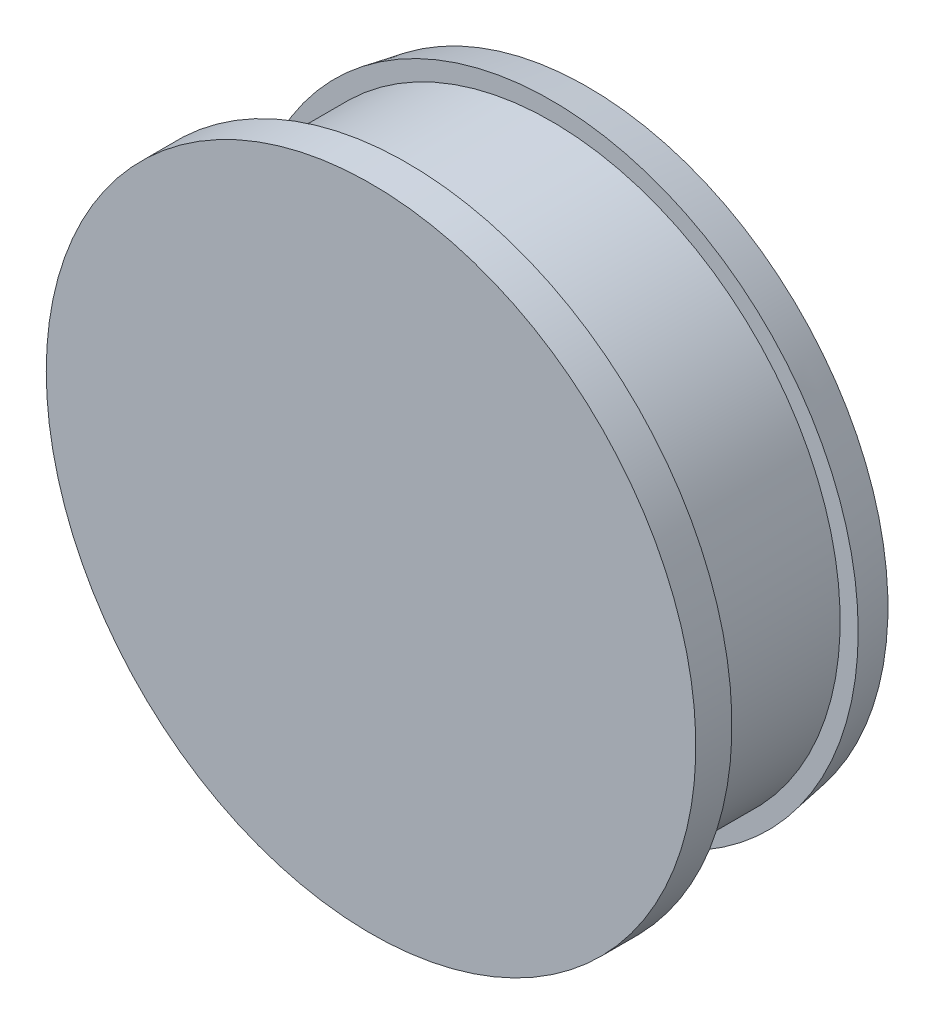
ISO-10303-21;
HEADER;
FILE_DESCRIPTION(('STEP AP214'),'2;1');
FILE_NAME('part.step','',(''),(''),'','','');
FILE_SCHEMA(('AUTOMOTIVE_DESIGN { 1 0 10303 214 1 1 1 1 }'));
ENDSEC;
DATA;
#1=APPLICATION_CONTEXT('core data for automotive mechanical design processes');
#2=APPLICATION_PROTOCOL_DEFINITION('international standard','automotive_design',2000,#1);
#3=PRODUCT_CONTEXT('',#1,'mechanical');
#4=PRODUCT('Part','Part','',(#3));
#5=PRODUCT_RELATED_PRODUCT_CATEGORY('part','',(#4));
#6=PRODUCT_DEFINITION_FORMATION('','',#4);
#7=PRODUCT_DEFINITION_CONTEXT('part definition',#1,'design');
#8=PRODUCT_DEFINITION('design','',#6,#7);
#9=PRODUCT_DEFINITION_SHAPE('','',#8);
#10=(LENGTH_UNIT() NAMED_UNIT(*) SI_UNIT(.MILLI.,.METRE.));
#11=(NAMED_UNIT(*) PLANE_ANGLE_UNIT() SI_UNIT($,.RADIAN.));
#12=(NAMED_UNIT(*) SI_UNIT($,.STERADIAN.) SOLID_ANGLE_UNIT());
#13=UNCERTAINTY_MEASURE_WITH_UNIT(LENGTH_MEASURE(1.E-05),#10,'distance_accuracy_value','');
#14=(GEOMETRIC_REPRESENTATION_CONTEXT(3) GLOBAL_UNCERTAINTY_ASSIGNED_CONTEXT((#13)) GLOBAL_UNIT_ASSIGNED_CONTEXT((#10,
#11,#12)) REPRESENTATION_CONTEXT('',''));
#15=CARTESIAN_POINT('',(0.,0.,0.));
#16=DIRECTION('',(0.,0.,1.));
#17=DIRECTION('',(1.,0.,0.));
#18=AXIS2_PLACEMENT_3D('',#15,#16,#17);
#19=CARTESIAN_POINT('',(0.,0.,0.));
#20=DIRECTION('',(0.,0.,1.));
#21=DIRECTION('',(1.,0.,0.));
#22=AXIS2_PLACEMENT_3D('',#19,#20,#21);
#23=PLANE('',#22);
#24=CARTESIAN_POINT('',(0.,0.,0.));
#25=DIRECTION('',(0.,0.,-1.));
#26=DIRECTION('',(-1.,0.,0.));
#27=AXIS2_PLACEMENT_3D('',#24,#25,#26);
#28=CIRCLE('',#27,28.575);
#29=CARTESIAN_POINT('',(-28.575,0.,0.));
#30=VERTEX_POINT('',#29);
#31=EDGE_CURVE('E10',#30,#30,#28,.T.);
#32=ORIENTED_EDGE('',*,*,#31,.F.);
#33=EDGE_LOOP('',(#32));
#34=FACE_BOUND('',#33,.T.);
#35=ADVANCED_FACE('F41',(#34),#23,.T.);
#36=CARTESIAN_POINT('',(0.,0.,6.67508532423209));
#37=DIRECTION('',(0.,0.,-1.));
#38=DIRECTION('',(-1.,0.,0.));
#39=AXIS2_PLACEMENT_3D('',#36,#37,#38);
#40=CYLINDRICAL_SURFACE('',#39,28.575);
#41=ORIENTED_EDGE('',*,*,#31,.T.);
#42=EDGE_LOOP('',(#41));
#43=FACE_BOUND('',#42,.T.);
#44=CARTESIAN_POINT('',(0.,0.,-3.175));
#45=DIRECTION('',(0.,0.,-1.));
#46=DIRECTION('',(-1.,0.,0.));
#47=AXIS2_PLACEMENT_3D('',#44,#45,#46);
#48=CIRCLE('',#47,28.575);
#49=CARTESIAN_POINT('',(-28.575,0.,-3.175));
#50=VERTEX_POINT('',#49);
#51=EDGE_CURVE('E48',#50,#50,#48,.T.);
#52=ORIENTED_EDGE('',*,*,#51,.F.);
#53=EDGE_LOOP('',(#52));
#54=FACE_BOUND('',#53,.T.);
#55=ADVANCED_FACE('F89',(#43,#54),#40,.T.);
#56=CARTESIAN_POINT('',(0.,28.575,-3.175));
#57=DIRECTION('',(0.,0.,-1.));
#58=DIRECTION('',(-1.,0.,0.));
#59=AXIS2_PLACEMENT_3D('',#56,#57,#58);
#60=PLANE('',#59);
#61=ORIENTED_EDGE('',*,*,#51,.T.);
#62=EDGE_LOOP('',(#61));
#63=FACE_BOUND('',#62,.T.);
#64=CARTESIAN_POINT('',(0.,0.,-3.175));
#65=DIRECTION('',(0.,0.,-1.));
#66=DIRECTION('',(-1.,0.,0.));
#67=AXIS2_PLACEMENT_3D('',#64,#65,#66);
#68=CIRCLE('',#67,25.4);
#69=CARTESIAN_POINT('',(-25.4,0.,-3.175));
#70=VERTEX_POINT('',#69);
#71=EDGE_CURVE('E53',#70,#70,#68,.T.);
#72=ORIENTED_EDGE('',*,*,#71,.F.);
#73=EDGE_LOOP('',(#72));
#74=FACE_BOUND('',#73,.T.);
#75=ADVANCED_FACE('F94',(#63,#74),#60,.T.);
#76=CARTESIAN_POINT('',(0.,0.,6.67508532423209));
#77=DIRECTION('',(0.,0.,-1.));
#78=DIRECTION('',(-1.,0.,0.));
#79=AXIS2_PLACEMENT_3D('',#76,#77,#78);
#80=CYLINDRICAL_SURFACE('',#79,25.4);
#81=ORIENTED_EDGE('',*,*,#71,.T.);
#82=EDGE_LOOP('',(#81));
#83=FACE_BOUND('',#82,.T.);
#84=CARTESIAN_POINT('',(0.,0.,-15.875));
#85=DIRECTION('',(0.,0.,-1.));
#86=DIRECTION('',(-1.,0.,0.));
#87=AXIS2_PLACEMENT_3D('',#84,#85,#86);
#88=CIRCLE('',#87,25.4);
#89=CARTESIAN_POINT('',(-25.4,0.,-15.875));
#90=VERTEX_POINT('',#89);
#91=EDGE_CURVE('E58',#90,#90,#88,.T.);
#92=ORIENTED_EDGE('',*,*,#91,.F.);
#93=EDGE_LOOP('',(#92));
#94=FACE_BOUND('',#93,.T.);
#95=ADVANCED_FACE('F85',(#83,#94),#80,.T.);
#96=CARTESIAN_POINT('',(0.,25.4,-15.875));
#97=DIRECTION('',(0.,0.,1.));
#98=DIRECTION('',(1.,0.,0.));
#99=AXIS2_PLACEMENT_3D('',#96,#97,#98);
#100=PLANE('',#99);
#101=ORIENTED_EDGE('',*,*,#91,.T.);
#102=EDGE_LOOP('',(#101));
#103=FACE_BOUND('',#102,.T.);
#104=CARTESIAN_POINT('',(0.,0.,-15.875));
#105=DIRECTION('',(0.,0.,-1.));
#106=DIRECTION('',(-1.,0.,0.));
#107=AXIS2_PLACEMENT_3D('',#104,#105,#106);
#108=CIRCLE('',#107,26.9875);
#109=CARTESIAN_POINT('',(-26.9875,0.,-15.875));
#110=VERTEX_POINT('',#109);
#111=EDGE_CURVE('E64',#110,#110,#108,.T.);
#112=ORIENTED_EDGE('',*,*,#111,.F.);
#113=EDGE_LOOP('',(#112));
#114=FACE_BOUND('',#113,.T.);
#115=ADVANCED_FACE('F77',(#103,#114),#100,.T.);
#116=CARTESIAN_POINT('',(0.,0.,-19.05));
#117=DIRECTION('',(0.,0.,1.));
#118=DIRECTION('',(1.,0.,0.));
#119=AXIS2_PLACEMENT_3D('',#116,#117,#118);
#120=CONICAL_SURFACE('',#119,26.4276618362506,0.174532925199433);
#121=ORIENTED_EDGE('',*,*,#111,.T.);
#122=EDGE_LOOP('',(#121));
#123=FACE_BOUND('',#122,.T.);
#124=CARTESIAN_POINT('',(0.,0.,-19.05));
#125=DIRECTION('',(0.,0.,-1.));
#126=DIRECTION('',(-1.,0.,0.));
#127=AXIS2_PLACEMENT_3D('',#124,#125,#126);
#128=CIRCLE('',#127,26.4276618362506);
#129=CARTESIAN_POINT('',(-26.4276618362506,0.,-19.05));
#130=VERTEX_POINT('',#129);
#131=EDGE_CURVE('E68',#130,#130,#128,.T.);
#132=ORIENTED_EDGE('',*,*,#131,.F.);
#133=EDGE_LOOP('',(#132));
#134=FACE_BOUND('',#133,.T.);
#135=ADVANCED_FACE('F75',(#123,#134),#120,.T.);
#136=CARTESIAN_POINT('',(0.,26.4276618362506,-19.05));
#137=DIRECTION('',(0.,0.,-1.));
#138=DIRECTION('',(-1.,0.,0.));
#139=AXIS2_PLACEMENT_3D('',#136,#137,#138);
#140=PLANE('',#139);
#141=ORIENTED_EDGE('',*,*,#131,.T.);
#142=EDGE_LOOP('',(#141));
#143=FACE_BOUND('',#142,.T.);
#144=ADVANCED_FACE('F73',(#143),#140,.T.);
#145=CLOSED_SHELL('',(#35,#55,#75,#95,#115,#135,#144));
#146=MANIFOLD_SOLID_BREP('B2',#145);
#147=ADVANCED_BREP_SHAPE_REPRESENTATION('',(#18,#146),#14);
#148=SHAPE_DEFINITION_REPRESENTATION(#9,#147);
ENDSEC;
END-ISO-10303-21;
